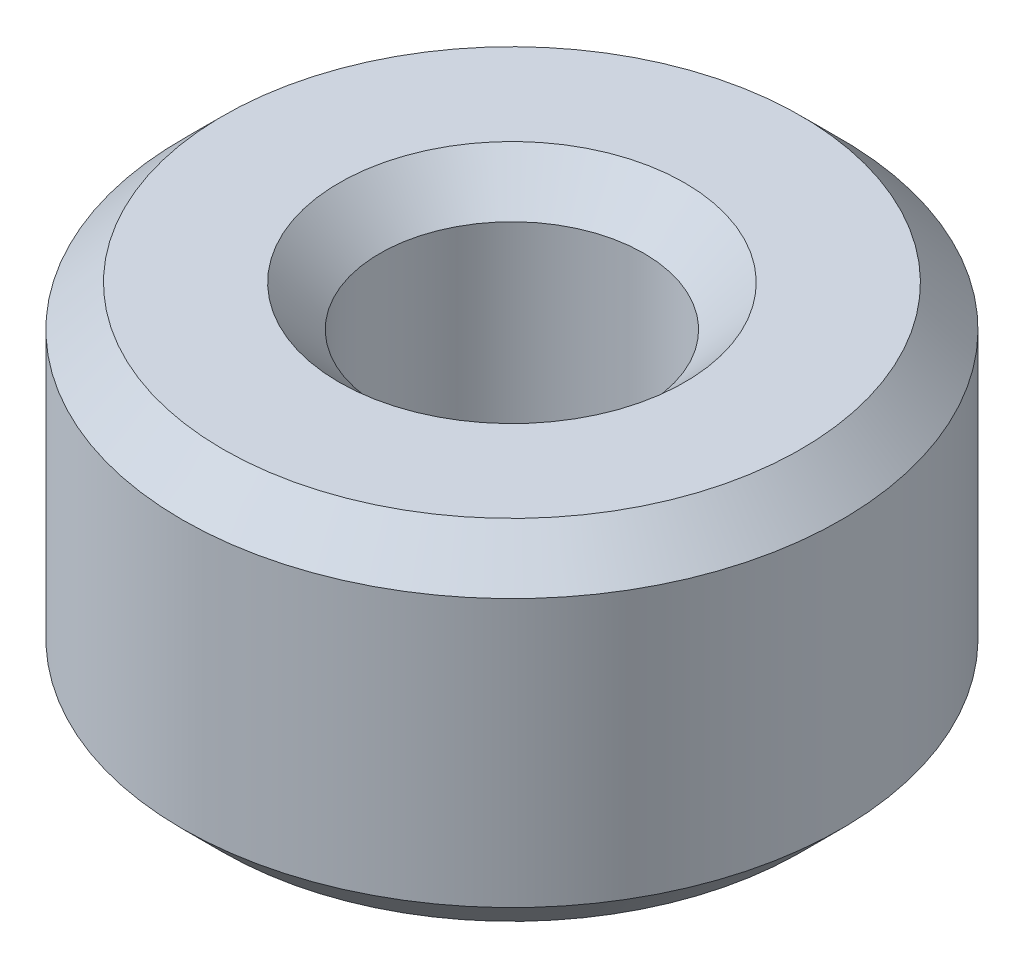
ISO-10303-21;
HEADER;
FILE_DESCRIPTION(('STEP AP214'),'2;1');
FILE_NAME('part.step','',(''),(''),'','','');
FILE_SCHEMA(('AUTOMOTIVE_DESIGN { 1 0 10303 214 1 1 1 1 }'));
ENDSEC;
DATA;
#1=APPLICATION_CONTEXT('core data for automotive mechanical design processes');
#2=APPLICATION_PROTOCOL_DEFINITION('international standard','automotive_design',2000,#1);
#3=PRODUCT_CONTEXT('',#1,'mechanical');
#4=PRODUCT('Part','Part','',(#3));
#5=PRODUCT_RELATED_PRODUCT_CATEGORY('part','',(#4));
#6=PRODUCT_DEFINITION_FORMATION('','',#4);
#7=PRODUCT_DEFINITION_CONTEXT('part definition',#1,'design');
#8=PRODUCT_DEFINITION('design','',#6,#7);
#9=PRODUCT_DEFINITION_SHAPE('','',#8);
#10=(LENGTH_UNIT() NAMED_UNIT(*) SI_UNIT(.MILLI.,.METRE.));
#11=(NAMED_UNIT(*) PLANE_ANGLE_UNIT() SI_UNIT($,.RADIAN.));
#12=(NAMED_UNIT(*) SI_UNIT($,.STERADIAN.) SOLID_ANGLE_UNIT());
#13=UNCERTAINTY_MEASURE_WITH_UNIT(LENGTH_MEASURE(1.E-05),#10,'distance_accuracy_value','');
#14=(GEOMETRIC_REPRESENTATION_CONTEXT(3) GLOBAL_UNCERTAINTY_ASSIGNED_CONTEXT((#13)) GLOBAL_UNIT_ASSIGNED_CONTEXT((#10,
#11,#12)) REPRESENTATION_CONTEXT('',''));
#15=CARTESIAN_POINT('',(0.,0.,0.));
#16=DIRECTION('',(0.,0.,1.));
#17=DIRECTION('',(1.,0.,0.));
#18=AXIS2_PLACEMENT_3D('',#15,#16,#17);
#19=CARTESIAN_POINT('',(0.,18.5310240094259,0.));
#20=DIRECTION('',(0.,-1.,0.));
#21=DIRECTION('',(0.,0.,-1.));
#22=AXIS2_PLACEMENT_3D('',#19,#20,#21);
#23=CYLINDRICAL_SURFACE('',#22,17.5);
#24=CARTESIAN_POINT('',(0.,2.16168822088595,0.));
#25=DIRECTION('',(0.,1.,0.));
#26=DIRECTION('',(0.,0.,1.));
#27=AXIS2_PLACEMENT_3D('',#24,#25,#26);
#28=CIRCLE('',#27,17.5);
#29=CARTESIAN_POINT('',(0.,2.16168822088595,17.5));
#30=VERTEX_POINT('',#29);
#31=EDGE_CURVE('E10',#30,#30,#28,.T.);
#32=ORIENTED_EDGE('',*,*,#31,.T.);
#33=EDGE_LOOP('',(#32));
#34=FACE_BOUND('',#33,.T.);
#35=CARTESIAN_POINT('',(0.,16.3693357885399,0.));
#36=DIRECTION('',(0.,1.,0.));
#37=DIRECTION('',(0.,0.,1.));
#38=AXIS2_PLACEMENT_3D('',#35,#36,#37);
#39=CIRCLE('',#38,17.5);
#40=CARTESIAN_POINT('',(0.,16.3693357885399,17.5));
#41=VERTEX_POINT('',#40);
#42=EDGE_CURVE('E50',#41,#41,#39,.F.);
#43=ORIENTED_EDGE('',*,*,#42,.T.);
#44=EDGE_LOOP('',(#43));
#45=FACE_BOUND('',#44,.T.);
#46=ADVANCED_FACE('F39',(#34,#45),#23,.T.);
#47=CARTESIAN_POINT('',(0.,18.5310240094259,0.));
#48=DIRECTION('',(0.,1.,0.));
#49=DIRECTION('',(0.,0.,1.));
#50=AXIS2_PLACEMENT_3D('',#47,#48,#49);
#51=PLANE('',#50);
#52=CARTESIAN_POINT('',(0.,18.5310240094259,0.));
#53=DIRECTION('',(0.,1.,0.));
#54=DIRECTION('',(0.,0.,1.));
#55=AXIS2_PLACEMENT_3D('',#52,#53,#54);
#56=CIRCLE('',#55,9.1732653625726);
#57=CARTESIAN_POINT('',(0.,18.5310240094259,9.1732653625726));
#58=VERTEX_POINT('',#57);
#59=EDGE_CURVE('E58',#58,#58,#56,.F.);
#60=ORIENTED_EDGE('',*,*,#59,.T.);
#61=EDGE_LOOP('',(#60));
#62=FACE_BOUND('',#61,.T.);
#63=CARTESIAN_POINT('',(0.,18.5310240094259,0.));
#64=DIRECTION('',(0.,1.,0.));
#65=DIRECTION('',(0.,0.,1.));
#66=AXIS2_PLACEMENT_3D('',#63,#64,#65);
#67=CIRCLE('',#66,15.3383117791141);
#68=CARTESIAN_POINT('',(0.,18.5310240094259,15.3383117791141));
#69=VERTEX_POINT('',#68);
#70=EDGE_CURVE('E61',#69,#69,#67,.T.);
#71=ORIENTED_EDGE('',*,*,#70,.T.);
#72=EDGE_LOOP('',(#71));
#73=FACE_BOUND('',#72,.T.);
#74=ADVANCED_FACE('F88',(#62,#73),#51,.T.);
#75=CARTESIAN_POINT('',(0.,0.,0.));
#76=DIRECTION('',(0.,1.,0.));
#77=DIRECTION('',(0.,0.,1.));
#78=AXIS2_PLACEMENT_3D('',#75,#76,#77);
#79=PLANE('',#78);
#80=CARTESIAN_POINT('',(0.,0.,0.));
#81=DIRECTION('',(0.,1.,0.));
#82=DIRECTION('',(0.,0.,1.));
#83=AXIS2_PLACEMENT_3D('',#80,#81,#82);
#84=CIRCLE('',#83,9.17326536257261);
#85=CARTESIAN_POINT('',(0.,0.,9.17326536257261));
#86=VERTEX_POINT('',#85);
#87=EDGE_CURVE('E51',#86,#86,#84,.T.);
#88=ORIENTED_EDGE('',*,*,#87,.T.);
#89=EDGE_LOOP('',(#88));
#90=FACE_BOUND('',#89,.T.);
#91=CARTESIAN_POINT('',(0.,0.,0.));
#92=DIRECTION('',(0.,1.,0.));
#93=DIRECTION('',(0.,0.,1.));
#94=AXIS2_PLACEMENT_3D('',#91,#92,#93);
#95=CIRCLE('',#94,15.338311779114);
#96=CARTESIAN_POINT('',(0.,0.,15.338311779114));
#97=VERTEX_POINT('',#96);
#98=EDGE_CURVE('E54',#97,#97,#95,.F.);
#99=ORIENTED_EDGE('',*,*,#98,.T.);
#100=EDGE_LOOP('',(#99));
#101=FACE_BOUND('',#100,.T.);
#102=ADVANCED_FACE('F83',(#90,#101),#79,.F.);
#103=CARTESIAN_POINT('',(0.,18.5310240094259,0.));
#104=DIRECTION('',(0.,-1.,0.));
#105=DIRECTION('',(0.,0.,-1.));
#106=AXIS2_PLACEMENT_3D('',#103,#104,#105);
#107=CYLINDRICAL_SURFACE('',#106,7.01157714168665);
#108=CARTESIAN_POINT('',(0.,16.3693357885399,0.));
#109=DIRECTION('',(0.,1.,0.));
#110=DIRECTION('',(0.,0.,1.));
#111=AXIS2_PLACEMENT_3D('',#108,#109,#110);
#112=CIRCLE('',#111,7.01157714168665);
#113=CARTESIAN_POINT('',(0.,16.3693357885399,7.01157714168665));
#114=VERTEX_POINT('',#113);
#115=EDGE_CURVE('E67',#114,#114,#112,.T.);
#116=ORIENTED_EDGE('',*,*,#115,.T.);
#117=EDGE_LOOP('',(#116));
#118=FACE_BOUND('',#117,.T.);
#119=CARTESIAN_POINT('',(0.,2.16168822088597,0.));
#120=DIRECTION('',(0.,1.,0.));
#121=DIRECTION('',(0.,0.,1.));
#122=AXIS2_PLACEMENT_3D('',#119,#120,#121);
#123=CIRCLE('',#122,7.01157714168665);
#124=CARTESIAN_POINT('',(0.,2.16168822088597,7.01157714168665));
#125=VERTEX_POINT('',#124);
#126=EDGE_CURVE('E69',#125,#125,#123,.F.);
#127=ORIENTED_EDGE('',*,*,#126,.T.);
#128=EDGE_LOOP('',(#127));
#129=FACE_BOUND('',#128,.T.);
#130=ADVANCED_FACE('F71',(#118,#129),#107,.F.);
#131=CARTESIAN_POINT('',(0.,16.3693357885399,0.));
#132=DIRECTION('',(0.,1.,0.));
#133=DIRECTION('',(0.,0.,1.));
#134=AXIS2_PLACEMENT_3D('',#131,#132,#133);
#135=CONICAL_SURFACE('',#134,7.01157714168665,0.785398163397451);
#136=ORIENTED_EDGE('',*,*,#59,.F.);
#137=EDGE_LOOP('',(#136));
#138=FACE_BOUND('',#137,.T.);
#139=ORIENTED_EDGE('',*,*,#115,.F.);
#140=EDGE_LOOP('',(#139));
#141=FACE_BOUND('',#140,.T.);
#142=ADVANCED_FACE('F77',(#138,#141),#135,.F.);
#143=CARTESIAN_POINT('',(0.,0.,0.));
#144=DIRECTION('',(0.,-1.,0.));
#145=DIRECTION('',(0.,0.,-1.));
#146=AXIS2_PLACEMENT_3D('',#143,#144,#145);
#147=CONICAL_SURFACE('',#146,9.17326536257261,0.785398163397445);
#148=ORIENTED_EDGE('',*,*,#126,.F.);
#149=EDGE_LOOP('',(#148));
#150=FACE_BOUND('',#149,.T.);
#151=ORIENTED_EDGE('',*,*,#87,.F.);
#152=EDGE_LOOP('',(#151));
#153=FACE_BOUND('',#152,.T.);
#154=ADVANCED_FACE('F73',(#150,#153),#147,.F.);
#155=CARTESIAN_POINT('',(0.,2.16168822088595,0.));
#156=DIRECTION('',(0.,1.,0.));
#157=DIRECTION('',(0.,0.,1.));
#158=AXIS2_PLACEMENT_3D('',#155,#156,#157);
#159=CONICAL_SURFACE('',#158,17.5,0.785398163397452);
#160=ORIENTED_EDGE('',*,*,#98,.F.);
#161=EDGE_LOOP('',(#160));
#162=FACE_BOUND('',#161,.T.);
#163=ORIENTED_EDGE('',*,*,#31,.F.);
#164=EDGE_LOOP('',(#163));
#165=FACE_BOUND('',#164,.T.);
#166=ADVANCED_FACE('F76',(#162,#165),#159,.T.);
#167=CARTESIAN_POINT('',(0.,18.5310240094259,0.));
#168=DIRECTION('',(0.,-1.,0.));
#169=DIRECTION('',(0.,0.,-1.));
#170=AXIS2_PLACEMENT_3D('',#167,#168,#169);
#171=CONICAL_SURFACE('',#170,15.3383117791141,0.785398163397446);
#172=ORIENTED_EDGE('',*,*,#42,.F.);
#173=EDGE_LOOP('',(#172));
#174=FACE_BOUND('',#173,.T.);
#175=ORIENTED_EDGE('',*,*,#70,.F.);
#176=EDGE_LOOP('',(#175));
#177=FACE_BOUND('',#176,.T.);
#178=ADVANCED_FACE('F45',(#174,#177),#171,.T.);
#179=CLOSED_SHELL('',(#46,#74,#102,#130,#142,#154,#166,#178));
#180=MANIFOLD_SOLID_BREP('B2',#179);
#181=ADVANCED_BREP_SHAPE_REPRESENTATION('',(#18,#180),#14);
#182=SHAPE_DEFINITION_REPRESENTATION(#9,#181);
ENDSEC;
END-ISO-10303-21;
